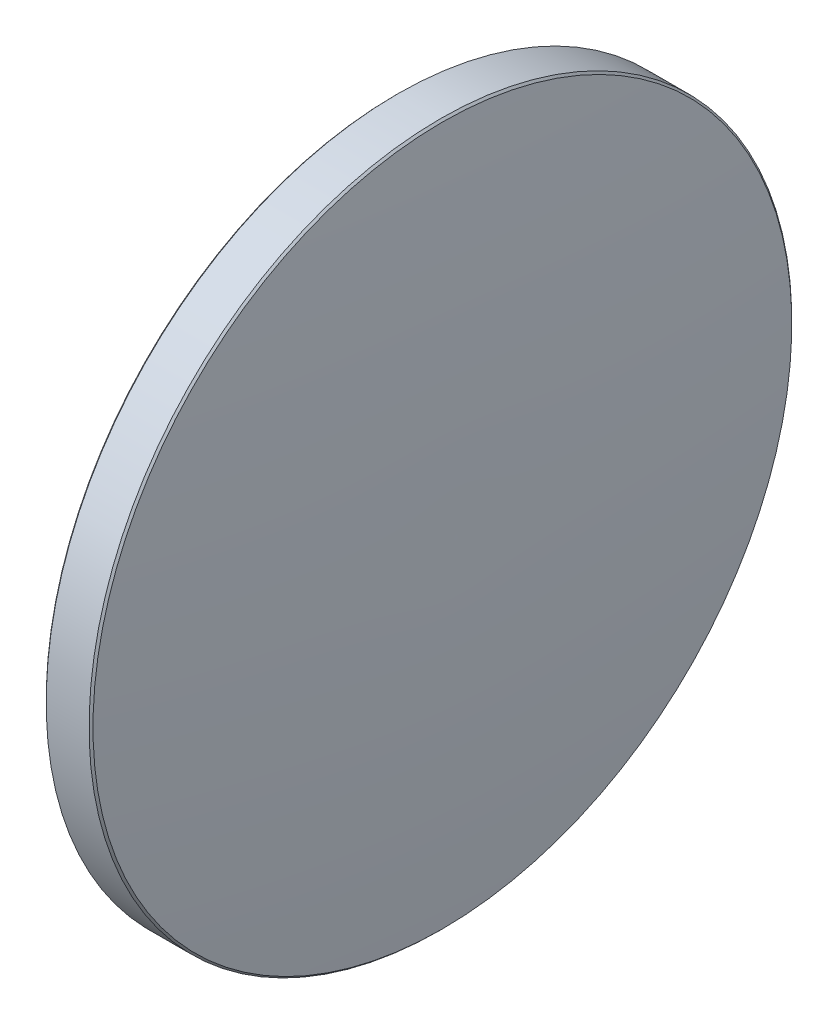
ISO-10303-21;
HEADER;
FILE_DESCRIPTION(('STEP AP214'),'2;1');
FILE_NAME('part.step','',(''),(''),'','','');
FILE_SCHEMA(('AUTOMOTIVE_DESIGN { 1 0 10303 214 1 1 1 1 }'));
ENDSEC;
DATA;
#1=APPLICATION_CONTEXT('core data for automotive mechanical design processes');
#2=APPLICATION_PROTOCOL_DEFINITION('international standard','automotive_design',2000,#1);
#3=PRODUCT_CONTEXT('',#1,'mechanical');
#4=PRODUCT('Part','Part','',(#3));
#5=PRODUCT_RELATED_PRODUCT_CATEGORY('part','',(#4));
#6=PRODUCT_DEFINITION_FORMATION('','',#4);
#7=PRODUCT_DEFINITION_CONTEXT('part definition',#1,'design');
#8=PRODUCT_DEFINITION('design','',#6,#7);
#9=PRODUCT_DEFINITION_SHAPE('','',#8);
#10=(LENGTH_UNIT() NAMED_UNIT(*) SI_UNIT(.MILLI.,.METRE.));
#11=(NAMED_UNIT(*) PLANE_ANGLE_UNIT() SI_UNIT($,.RADIAN.));
#12=(NAMED_UNIT(*) SI_UNIT($,.STERADIAN.) SOLID_ANGLE_UNIT());
#13=UNCERTAINTY_MEASURE_WITH_UNIT(LENGTH_MEASURE(1.E-05),#10,'distance_accuracy_value','');
#14=(GEOMETRIC_REPRESENTATION_CONTEXT(3) GLOBAL_UNCERTAINTY_ASSIGNED_CONTEXT((#13)) GLOBAL_UNIT_ASSIGNED_CONTEXT((#10,
#11,#12)) REPRESENTATION_CONTEXT('',''));
#15=CARTESIAN_POINT('',(0.,0.,0.));
#16=DIRECTION('',(0.,0.,1.));
#17=DIRECTION('',(1.,0.,0.));
#18=AXIS2_PLACEMENT_3D('',#15,#16,#17);
#19=CARTESIAN_POINT('',(272.494988281686,-1.66085057802028,0.));
#20=DIRECTION('',(0.,0.,-1.));
#21=DIRECTION('',(0.,-1.,0.));
#22=AXIS2_PLACEMENT_3D('',#19,#20,#21);
#23=CIRCLE('',#22,275.2);
#24=TRIMMED_CURVE('',#23,(PARAMETER_VALUE(-1.57683143093775)),
(PARAMETER_VALUE(1.57683143093775)),.T.,.PARAMETER.);
#25=CARTESIAN_POINT('',(272.494988281686,0.,0.));
#26=DIRECTION('',(-1.,0.,0.));
#27=AXIS1_PLACEMENT('',#25,#26);
#28=SURFACE_OF_REVOLUTION('',#24,#27);
#29=CARTESIAN_POINT('',(-2.7,0.,0.));
#30=VERTEX_POINT('',#29);
#31=VERTEX_LOOP('',#30);
#32=FACE_BOUND('',#31,.T.);
#33=CARTESIAN_POINT('',(-1.6914213562373,0.,0.));
#34=DIRECTION('',(-1.,0.,0.));
#35=DIRECTION('',(0.,-1.,0.));
#36=AXIS2_PLACEMENT_3D('',#33,#34,#35);
#37=CIRCLE('',#36,25.2585786437627);
#38=CARTESIAN_POINT('',(-1.6914213562373,-25.2585786437627,0.));
#39=VERTEX_POINT('',#38);
#40=EDGE_CURVE('E10',#39,#39,#37,.T.);
#41=ORIENTED_EDGE('',*,*,#40,.T.);
#42=EDGE_LOOP('',(#41));
#43=FACE_BOUND('',#42,.T.);
#44=ADVANCED_FACE('F15',(#32,#43),#28,.T.);
#45=CARTESIAN_POINT('',(-1.55,0.,0.));
#46=DIRECTION('',(1.,0.,0.));
#47=DIRECTION('',(0.,1.,0.));
#48=AXIS2_PLACEMENT_3D('',#45,#46,#47);
#49=CONICAL_SURFACE('',#48,25.4,0.785398163397449);
#50=ORIENTED_EDGE('',*,*,#40,.F.);
#51=EDGE_LOOP('',(#50));
#52=FACE_BOUND('',#51,.T.);
#53=CARTESIAN_POINT('',(-1.55,0.,0.));
#54=DIRECTION('',(-1.,0.,0.));
#55=DIRECTION('',(0.,-1.,0.));
#56=AXIS2_PLACEMENT_3D('',#53,#54,#55);
#57=CIRCLE('',#56,25.4);
#58=CARTESIAN_POINT('',(-1.54999999999999,-25.4,0.));
#59=VERTEX_POINT('',#58);
#60=EDGE_CURVE('E22',#59,#59,#57,.T.);
#61=ORIENTED_EDGE('',*,*,#60,.T.);
#62=EDGE_LOOP('',(#61));
#63=FACE_BOUND('',#62,.T.);
#64=ADVANCED_FACE('F30',(#52,#63),#49,.T.);
#65=CARTESIAN_POINT('',(-2.7,0.,0.));
#66=DIRECTION('',(-1.,0.,0.));
#67=DIRECTION('',(0.,-1.,0.));
#68=AXIS2_PLACEMENT_3D('',#65,#66,#67);
#69=CYLINDRICAL_SURFACE('',#68,25.4);
#70=ORIENTED_EDGE('',*,*,#60,.F.);
#71=EDGE_LOOP('',(#70));
#72=FACE_BOUND('',#71,.T.);
#73=CARTESIAN_POINT('',(1.55,0.,0.));
#74=DIRECTION('',(-1.,0.,0.));
#75=DIRECTION('',(0.,-1.,0.));
#76=AXIS2_PLACEMENT_3D('',#73,#74,#75);
#77=CIRCLE('',#76,25.4);
#78=CARTESIAN_POINT('',(1.55000000000001,-25.4,0.));
#79=VERTEX_POINT('',#78);
#80=EDGE_CURVE('E39',#79,#79,#77,.T.);
#81=ORIENTED_EDGE('',*,*,#80,.T.);
#82=EDGE_LOOP('',(#81));
#83=FACE_BOUND('',#82,.T.);
#84=ADVANCED_FACE('F35',(#72,#83),#69,.T.);
#85=CARTESIAN_POINT('',(1.69142135623729,0.,0.));
#86=DIRECTION('',(-1.,0.,0.));
#87=DIRECTION('',(0.,-1.,0.));
#88=AXIS2_PLACEMENT_3D('',#85,#86,#87);
#89=CONICAL_SURFACE('',#88,25.2585786437627,0.785398163397525);
#90=ORIENTED_EDGE('',*,*,#80,.F.);
#91=EDGE_LOOP('',(#90));
#92=FACE_BOUND('',#91,.T.);
#93=CARTESIAN_POINT('',(1.69142135623729,0.,0.));
#94=DIRECTION('',(-1.,0.,0.));
#95=DIRECTION('',(0.,-1.,0.));
#96=AXIS2_PLACEMENT_3D('',#93,#94,#95);
#97=CIRCLE('',#96,25.2585786437627);
#98=CARTESIAN_POINT('',(1.6914213562373,-25.2585786437627,0.));
#99=VERTEX_POINT('',#98);
#100=EDGE_CURVE('E41',#99,#99,#97,.T.);
#101=ORIENTED_EDGE('',*,*,#100,.T.);
#102=EDGE_LOOP('',(#101));
#103=FACE_BOUND('',#102,.T.);
#104=ADVANCED_FACE('F47',(#92,#103),#89,.T.);
#105=CARTESIAN_POINT('',(-272.494988281686,-1.66085057802052,0.));
#106=DIRECTION('',(0.,0.,-1.));
#107=DIRECTION('',(0.,-1.,0.));
#108=AXIS2_PLACEMENT_3D('',#105,#106,#107);
#109=CIRCLE('',#108,275.2);
#110=TRIMMED_CURVE('',#109,(PARAMETER_VALUE(-1.57683143093775)),
(PARAMETER_VALUE(1.57683143093775)),.T.,.PARAMETER.);
#111=CARTESIAN_POINT('',(-272.494988281686,0.,0.));
#112=DIRECTION('',(-1.,0.,0.));
#113=AXIS1_PLACEMENT('',#111,#112);
#114=SURFACE_OF_REVOLUTION('',#110,#113);
#115=ORIENTED_EDGE('',*,*,#100,.F.);
#116=EDGE_LOOP('',(#115));
#117=FACE_BOUND('',#116,.T.);
#118=CARTESIAN_POINT('',(2.7,0.,0.));
#119=VERTEX_POINT('',#118);
#120=VERTEX_LOOP('',#119);
#121=FACE_BOUND('',#120,.T.);
#122=ADVANCED_FACE('F49',(#117,#121),#114,.T.);
#123=CLOSED_SHELL('',(#44,#64,#84,#104,#122));
#124=MANIFOLD_SOLID_BREP('B1',#123);
#125=ADVANCED_BREP_SHAPE_REPRESENTATION('',(#18,#124),#14);
#126=SHAPE_DEFINITION_REPRESENTATION(#9,#125);
ENDSEC;
END-ISO-10303-21;
